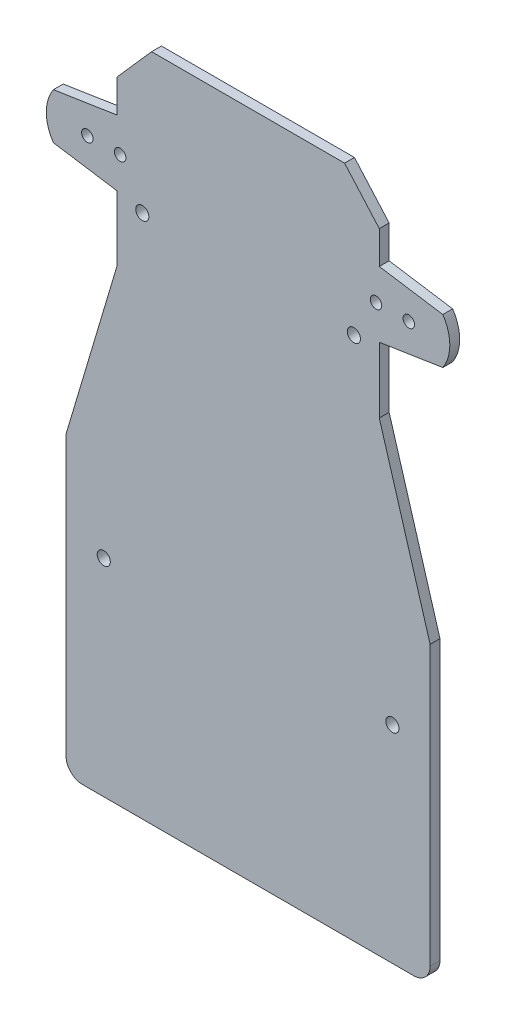
ISO-10303-21;
HEADER;
FILE_DESCRIPTION(('STEP AP214'),'2;1');
FILE_NAME('part.step','',(''),(''),'','','');
FILE_SCHEMA(('AUTOMOTIVE_DESIGN { 1 0 10303 214 1 1 1 1 }'));
ENDSEC;
DATA;
#1=APPLICATION_CONTEXT('core data for automotive mechanical design processes');
#2=APPLICATION_PROTOCOL_DEFINITION('international standard','automotive_design',2000,#1);
#3=PRODUCT_CONTEXT('',#1,'mechanical');
#4=PRODUCT('Part','Part','',(#3));
#5=PRODUCT_RELATED_PRODUCT_CATEGORY('part','',(#4));
#6=PRODUCT_DEFINITION_FORMATION('','',#4);
#7=PRODUCT_DEFINITION_CONTEXT('part definition',#1,'design');
#8=PRODUCT_DEFINITION('design','',#6,#7);
#9=PRODUCT_DEFINITION_SHAPE('','',#8);
#10=(LENGTH_UNIT() NAMED_UNIT(*) SI_UNIT(.MILLI.,.METRE.));
#11=(NAMED_UNIT(*) PLANE_ANGLE_UNIT() SI_UNIT($,.RADIAN.));
#12=(NAMED_UNIT(*) SI_UNIT($,.STERADIAN.) SOLID_ANGLE_UNIT());
#13=UNCERTAINTY_MEASURE_WITH_UNIT(LENGTH_MEASURE(1.E-05),#10,'distance_accuracy_value','');
#14=(GEOMETRIC_REPRESENTATION_CONTEXT(3) GLOBAL_UNCERTAINTY_ASSIGNED_CONTEXT((#13)) GLOBAL_UNIT_ASSIGNED_CONTEXT((#10,
#11,#12)) REPRESENTATION_CONTEXT('',''));
#15=CARTESIAN_POINT('',(0.,0.,0.));
#16=DIRECTION('',(0.,0.,1.));
#17=DIRECTION('',(1.,0.,0.));
#18=AXIS2_PLACEMENT_3D('',#15,#16,#17);
#19=CARTESIAN_POINT('',(-49.,172.,3.));
#20=DIRECTION('',(0.,0.,1.));
#21=DIRECTION('',(1.,0.,0.));
#22=AXIS2_PLACEMENT_3D('',#19,#20,#21);
#23=PLANE('',#22);
#24=CARTESIAN_POINT('',(32.2499999999999,160.,3.));
#25=DIRECTION('',(0.,0.,-1.));
#26=DIRECTION('',(-1.,0.,0.));
#27=AXIS2_PLACEMENT_3D('',#24,#25,#26);
#28=CIRCLE('',#27,2.);
#29=CARTESIAN_POINT('',(30.2499999999999,160.,3.));
#30=VERTEX_POINT('',#29);
#31=EDGE_CURVE('E641',#30,#30,#28,.T.);
#32=ORIENTED_EDGE('',*,*,#31,.T.);
#33=EDGE_LOOP('',(#32));
#34=FACE_BOUND('',#33,.T.);
#35=CARTESIAN_POINT('',(-39.,172.,3.));
#36=DIRECTION('',(0.,0.,1.));
#37=DIRECTION('',(1.,0.,0.));
#38=AXIS2_PLACEMENT_3D('',#35,#36,#37);
#39=CIRCLE('',#38,1.75);
#40=CARTESIAN_POINT('',(-37.25,172.,3.));
#41=VERTEX_POINT('',#40);
#42=EDGE_CURVE('E667',#41,#41,#39,.T.);
#43=ORIENTED_EDGE('',*,*,#42,.F.);
#44=EDGE_LOOP('',(#43));
#45=FACE_BOUND('',#44,.T.);
#46=CARTESIAN_POINT('',(-49.,172.,3.));
#47=DIRECTION('',(0.,0.,1.));
#48=DIRECTION('',(1.,0.,0.));
#49=AXIS2_PLACEMENT_3D('',#46,#47,#48);
#50=CIRCLE('',#49,1.75);
#51=CARTESIAN_POINT('',(-47.25,172.,3.));
#52=VERTEX_POINT('',#51);
#53=EDGE_CURVE('E679',#52,#52,#50,.T.);
#54=ORIENTED_EDGE('',*,*,#53,.F.);
#55=EDGE_LOOP('',(#54));
#56=FACE_BOUND('',#55,.T.);
#57=DIRECTION('',(1.,0.,0.));
#58=VECTOR('',#57,1.);
#59=CARTESIAN_POINT('',(-55.5,0.,3.));
#60=LINE('',#59,#58);
#61=CARTESIAN_POINT('',(-50.5,0.,3.));
#62=VERTEX_POINT('',#61);
#63=CARTESIAN_POINT('',(50.5,0.,3.));
#64=VERTEX_POINT('',#63);
#65=EDGE_CURVE('E220',#62,#64,#60,.T.);
#66=ORIENTED_EDGE('',*,*,#65,.T.);
#67=CARTESIAN_POINT('',(50.5,5.,3.));
#68=DIRECTION('',(0.,0.,1.));
#69=DIRECTION('',(1.,0.,0.));
#70=AXIS2_PLACEMENT_3D('',#67,#68,#69);
#71=CIRCLE('',#70,5.);
#72=CARTESIAN_POINT('',(55.5,5.00000000000003,3.));
#73=VERTEX_POINT('',#72);
#74=EDGE_CURVE('E43',#64,#73,#71,.T.);
#75=ORIENTED_EDGE('',*,*,#74,.T.);
#76=DIRECTION('',(0.,1.,0.));
#77=VECTOR('',#76,1.);
#78=CARTESIAN_POINT('',(55.5,90.,3.));
#79=LINE('',#78,#77);
#80=CARTESIAN_POINT('',(55.5,90.,3.));
#81=VERTEX_POINT('',#80);
#82=EDGE_CURVE('E218',#73,#81,#79,.T.);
#83=ORIENTED_EDGE('',*,*,#82,.T.);
#84=DIRECTION('',(-0.28565666154309,0.958332025821978,0.));
#85=VECTOR('',#84,1.);
#86=CARTESIAN_POINT('',(40.,142.,3.));
#87=LINE('',#86,#85);
#88=CARTESIAN_POINT('',(40.,142.,3.));
#89=VERTEX_POINT('',#88);
#90=EDGE_CURVE('E229',#81,#89,#87,.T.);
#91=ORIENTED_EDGE('',*,*,#90,.T.);
#92=DIRECTION('',(0.,1.,0.));
#93=VECTOR('',#92,1.);
#94=CARTESIAN_POINT('',(40.,162.,3.));
#95=LINE('',#94,#93);
#96=CARTESIAN_POINT('',(40.,162.,3.));
#97=VERTEX_POINT('',#96);
#98=EDGE_CURVE('E337',#89,#97,#95,.T.);
#99=ORIENTED_EDGE('',*,*,#98,.T.);
#100=DIRECTION('',(0.988201285573236,0.15316076257124,0.));
#101=VECTOR('',#100,1.);
#102=CARTESIAN_POINT('',(59.356157588604,165.,3.));
#103=LINE('',#102,#101);
#104=CARTESIAN_POINT('',(59.356157588604,165.,3.));
#105=VERTEX_POINT('',#104);
#106=EDGE_CURVE('E339',#97,#105,#103,.T.);
#107=ORIENTED_EDGE('',*,*,#106,.T.);
#108=CARTESIAN_POINT('',(49.,172.,3.));
#109=DIRECTION('',(0.,0.,1.));
#110=DIRECTION('',(1.,0.,0.));
#111=AXIS2_PLACEMENT_3D('',#108,#109,#110);
#112=CIRCLE('',#111,12.5);
#113=CARTESIAN_POINT('',(59.356157588604,179.,3.));
#114=VERTEX_POINT('',#113);
#115=EDGE_CURVE('E341',#105,#114,#112,.T.);
#116=ORIENTED_EDGE('',*,*,#115,.T.);
#117=DIRECTION('',(-0.988201285573236,0.15316076257124,0.));
#118=VECTOR('',#117,1.);
#119=CARTESIAN_POINT('',(39.9999999999999,182.,3.));
#120=LINE('',#119,#118);
#121=CARTESIAN_POINT('',(39.9999999999999,182.,3.));
#122=VERTEX_POINT('',#121);
#123=EDGE_CURVE('E343',#114,#122,#120,.T.);
#124=ORIENTED_EDGE('',*,*,#123,.T.);
#125=DIRECTION('',(0.,1.,0.));
#126=VECTOR('',#125,1.);
#127=CARTESIAN_POINT('',(39.9999999999999,192.,3.));
#128=LINE('',#127,#126);
#129=CARTESIAN_POINT('',(39.9999999999999,192.,3.));
#130=VERTEX_POINT('',#129);
#131=EDGE_CURVE('E345',#122,#130,#128,.T.);
#132=ORIENTED_EDGE('',*,*,#131,.T.);
#133=DIRECTION('',(-0.661437827766152,0.749999999999997,0.));
#134=VECTOR('',#133,1.);
#135=CARTESIAN_POINT('',(29.4169947557416,204.,3.));
#136=LINE('',#135,#134);
#137=CARTESIAN_POINT('',(29.4169947557416,204.,3.));
#138=VERTEX_POINT('',#137);
#139=EDGE_CURVE('E347',#130,#138,#136,.T.);
#140=ORIENTED_EDGE('',*,*,#139,.T.);
#141=DIRECTION('',(-1.,0.,0.));
#142=VECTOR('',#141,1.);
#143=CARTESIAN_POINT('',(-29.4169947557416,204.,3.));
#144=LINE('',#143,#142);
#145=CARTESIAN_POINT('',(-29.4169947557416,204.,3.));
#146=VERTEX_POINT('',#145);
#147=EDGE_CURVE('E190',#138,#146,#144,.T.);
#148=ORIENTED_EDGE('',*,*,#147,.T.);
#149=DIRECTION('',(-0.661437827766151,-0.749999999999997,0.));
#150=VECTOR('',#149,1.);
#151=CARTESIAN_POINT('',(-29.4169947557416,204.,3.));
#152=LINE('',#151,#150);
#153=CARTESIAN_POINT('',(-40.,192.,3.));
#154=VERTEX_POINT('',#153);
#155=EDGE_CURVE('E185',#146,#154,#152,.T.);
#156=ORIENTED_EDGE('',*,*,#155,.T.);
#157=DIRECTION('',(0.,-1.,0.));
#158=VECTOR('',#157,1.);
#159=CARTESIAN_POINT('',(-40.,192.,3.));
#160=LINE('',#159,#158);
#161=CARTESIAN_POINT('',(-40.,182.,3.));
#162=VERTEX_POINT('',#161);
#163=EDGE_CURVE('E174',#154,#162,#160,.T.);
#164=ORIENTED_EDGE('',*,*,#163,.T.);
#165=DIRECTION('',(-0.988201285573236,-0.153160762571241,0.));
#166=VECTOR('',#165,1.);
#167=CARTESIAN_POINT('',(-40.,182.,3.));
#168=LINE('',#167,#166);
#169=CARTESIAN_POINT('',(-59.356157588604,179.,3.));
#170=VERTEX_POINT('',#169);
#171=EDGE_CURVE('E184',#162,#170,#168,.T.);
#172=ORIENTED_EDGE('',*,*,#171,.T.);
#173=CARTESIAN_POINT('',(-49.,172.,3.));
#174=DIRECTION('',(0.,0.,1.));
#175=DIRECTION('',(1.,0.,0.));
#176=AXIS2_PLACEMENT_3D('',#173,#174,#175);
#177=CIRCLE('',#176,12.5);
#178=CARTESIAN_POINT('',(-59.356157588604,165.,3.));
#179=VERTEX_POINT('',#178);
#180=EDGE_CURVE('E306',#170,#179,#177,.T.);
#181=ORIENTED_EDGE('',*,*,#180,.T.);
#182=DIRECTION('',(0.988201285573236,-0.15316076257124,0.));
#183=VECTOR('',#182,1.);
#184=CARTESIAN_POINT('',(-59.356157588604,165.,3.));
#185=LINE('',#184,#183);
#186=CARTESIAN_POINT('',(-40.,162.,3.));
#187=VERTEX_POINT('',#186);
#188=EDGE_CURVE('E353',#179,#187,#185,.T.);
#189=ORIENTED_EDGE('',*,*,#188,.T.);
#190=DIRECTION('',(0.,-1.,0.));
#191=VECTOR('',#190,1.);
#192=CARTESIAN_POINT('',(-40.,162.,3.));
#193=LINE('',#192,#191);
#194=CARTESIAN_POINT('',(-40.,142.,3.));
#195=VERTEX_POINT('',#194);
#196=EDGE_CURVE('E357',#187,#195,#193,.T.);
#197=ORIENTED_EDGE('',*,*,#196,.T.);
#198=DIRECTION('',(-0.28565666154309,-0.958332025821978,0.));
#199=VECTOR('',#198,1.);
#200=CARTESIAN_POINT('',(-40.,142.,3.));
#201=LINE('',#200,#199);
#202=CARTESIAN_POINT('',(-55.5,90.,3.));
#203=VERTEX_POINT('',#202);
#204=EDGE_CURVE('E332',#195,#203,#201,.T.);
#205=ORIENTED_EDGE('',*,*,#204,.T.);
#206=DIRECTION('',(0.,-1.,0.));
#207=VECTOR('',#206,1.);
#208=CARTESIAN_POINT('',(-55.5,90.,3.));
#209=LINE('',#208,#207);
#210=CARTESIAN_POINT('',(-55.5,5.00000000000003,3.));
#211=VERTEX_POINT('',#210);
#212=EDGE_CURVE('E328',#203,#211,#209,.T.);
#213=ORIENTED_EDGE('',*,*,#212,.T.);
#214=CARTESIAN_POINT('',(-50.5,5.,3.));
#215=DIRECTION('',(0.,0.,1.));
#216=DIRECTION('',(1.,0.,0.));
#217=AXIS2_PLACEMENT_3D('',#214,#215,#216);
#218=CIRCLE('',#217,5.);
#219=EDGE_CURVE('E215',#211,#62,#218,.T.);
#220=ORIENTED_EDGE('',*,*,#219,.T.);
#221=EDGE_LOOP('',(#66,#75,#83,#91,#99,#107,#116,#124,#132,#140,#148,#156,#164,#172,#181,#189,
#197,#205,#213,#220));
#222=FACE_BOUND('',#221,.T.);
#223=CARTESIAN_POINT('',(49.,172.,3.));
#224=DIRECTION('',(0.,0.,1.));
#225=DIRECTION('',(1.,0.,0.));
#226=AXIS2_PLACEMENT_3D('',#223,#224,#225);
#227=CIRCLE('',#226,1.75);
#228=CARTESIAN_POINT('',(50.75,172.,3.));
#229=VERTEX_POINT('',#228);
#230=EDGE_CURVE('E350',#229,#229,#227,.T.);
#231=ORIENTED_EDGE('',*,*,#230,.F.);
#232=EDGE_LOOP('',(#231));
#233=FACE_BOUND('',#232,.T.);
#234=CARTESIAN_POINT('',(39.,172.,3.));
#235=DIRECTION('',(0.,0.,1.));
#236=DIRECTION('',(1.,0.,0.));
#237=AXIS2_PLACEMENT_3D('',#234,#235,#236);
#238=CIRCLE('',#237,1.75);
#239=CARTESIAN_POINT('',(40.75,172.,3.));
#240=VERTEX_POINT('',#239);
#241=EDGE_CURVE('E673',#240,#240,#238,.T.);
#242=ORIENTED_EDGE('',*,*,#241,.F.);
#243=EDGE_LOOP('',(#242));
#244=FACE_BOUND('',#243,.T.);
#245=CARTESIAN_POINT('',(44.,63.,3.));
#246=DIRECTION('',(0.,0.,-1.));
#247=DIRECTION('',(-1.,0.,0.));
#248=AXIS2_PLACEMENT_3D('',#245,#246,#247);
#249=CIRCLE('',#248,2.);
#250=CARTESIAN_POINT('',(42.,63.,3.));
#251=VERTEX_POINT('',#250);
#252=EDGE_CURVE('E663',#251,#251,#249,.T.);
#253=ORIENTED_EDGE('',*,*,#252,.T.);
#254=EDGE_LOOP('',(#253));
#255=FACE_BOUND('',#254,.T.);
#256=CARTESIAN_POINT('',(-44.,63.,3.));
#257=DIRECTION('',(0.,0.,-1.));
#258=DIRECTION('',(-1.,0.,0.));
#259=AXIS2_PLACEMENT_3D('',#256,#257,#258);
#260=CIRCLE('',#259,2.);
#261=CARTESIAN_POINT('',(-46.,63.,3.));
#262=VERTEX_POINT('',#261);
#263=EDGE_CURVE('E657',#262,#262,#260,.T.);
#264=ORIENTED_EDGE('',*,*,#263,.T.);
#265=EDGE_LOOP('',(#264));
#266=FACE_BOUND('',#265,.T.);
#267=CARTESIAN_POINT('',(-32.2500000000001,160.,3.));
#268=DIRECTION('',(0.,0.,-1.));
#269=DIRECTION('',(-1.,0.,0.));
#270=AXIS2_PLACEMENT_3D('',#267,#268,#269);
#271=CIRCLE('',#270,2.);
#272=CARTESIAN_POINT('',(-34.2500000000001,160.,3.));
#273=VERTEX_POINT('',#272);
#274=EDGE_CURVE('E651',#273,#273,#271,.T.);
#275=ORIENTED_EDGE('',*,*,#274,.T.);
#276=EDGE_LOOP('',(#275));
#277=FACE_BOUND('',#276,.T.);
#278=ADVANCED_FACE('F35',(#34,#45,#56,#222,#233,#244,#255,#266,#277),#23,.T.);
#279=CARTESIAN_POINT('',(-49.,172.,0.));
#280=DIRECTION('',(0.,0.,1.));
#281=DIRECTION('',(1.,0.,0.));
#282=AXIS2_PLACEMENT_3D('',#279,#280,#281);
#283=PLANE('',#282);
#284=CARTESIAN_POINT('',(32.2499999999999,160.,0.));
#285=DIRECTION('',(0.,0.,-1.));
#286=DIRECTION('',(-1.,0.,0.));
#287=AXIS2_PLACEMENT_3D('',#284,#285,#286);
#288=CIRCLE('',#287,2.);
#289=CARTESIAN_POINT('',(30.2499999999999,160.,0.));
#290=VERTEX_POINT('',#289);
#291=EDGE_CURVE('E644',#290,#290,#288,.T.);
#292=ORIENTED_EDGE('',*,*,#291,.F.);
#293=EDGE_LOOP('',(#292));
#294=FACE_BOUND('',#293,.T.);
#295=CARTESIAN_POINT('',(-32.2500000000001,160.,0.));
#296=DIRECTION('',(0.,0.,-1.));
#297=DIRECTION('',(-1.,0.,0.));
#298=AXIS2_PLACEMENT_3D('',#295,#296,#297);
#299=CIRCLE('',#298,2.);
#300=CARTESIAN_POINT('',(-34.2500000000001,160.,0.));
#301=VERTEX_POINT('',#300);
#302=EDGE_CURVE('E646',#301,#301,#299,.T.);
#303=ORIENTED_EDGE('',*,*,#302,.F.);
#304=EDGE_LOOP('',(#303));
#305=FACE_BOUND('',#304,.T.);
#306=CARTESIAN_POINT('',(-44.,63.,0.));
#307=DIRECTION('',(0.,0.,-1.));
#308=DIRECTION('',(-1.,0.,0.));
#309=AXIS2_PLACEMENT_3D('',#306,#307,#308);
#310=CIRCLE('',#309,2.);
#311=CARTESIAN_POINT('',(-46.,63.,0.));
#312=VERTEX_POINT('',#311);
#313=EDGE_CURVE('E654',#312,#312,#310,.T.);
#314=ORIENTED_EDGE('',*,*,#313,.F.);
#315=EDGE_LOOP('',(#314));
#316=FACE_BOUND('',#315,.T.);
#317=CARTESIAN_POINT('',(44.,63.,0.));
#318=DIRECTION('',(0.,0.,-1.));
#319=DIRECTION('',(-1.,0.,0.));
#320=AXIS2_PLACEMENT_3D('',#317,#318,#319);
#321=CIRCLE('',#320,2.);
#322=CARTESIAN_POINT('',(42.,63.,0.));
#323=VERTEX_POINT('',#322);
#324=EDGE_CURVE('E660',#323,#323,#321,.T.);
#325=ORIENTED_EDGE('',*,*,#324,.F.);
#326=EDGE_LOOP('',(#325));
#327=FACE_BOUND('',#326,.T.);
#328=DIRECTION('',(0.,1.,0.));
#329=VECTOR('',#328,1.);
#330=CARTESIAN_POINT('',(55.5,90.,0.));
#331=LINE('',#330,#329);
#332=CARTESIAN_POINT('',(55.5,5.00000000000003,0.));
#333=VERTEX_POINT('',#332);
#334=CARTESIAN_POINT('',(55.5,90.,0.));
#335=VERTEX_POINT('',#334);
#336=EDGE_CURVE('E238',#333,#335,#331,.T.);
#337=ORIENTED_EDGE('',*,*,#336,.F.);
#338=CARTESIAN_POINT('',(50.5,5.,0.));
#339=DIRECTION('',(0.,0.,1.));
#340=DIRECTION('',(1.,0.,0.));
#341=AXIS2_PLACEMENT_3D('',#338,#339,#340);
#342=CIRCLE('',#341,5.);
#343=CARTESIAN_POINT('',(50.5,0.,0.));
#344=VERTEX_POINT('',#343);
#345=EDGE_CURVE('E209',#333,#344,#342,.F.);
#346=ORIENTED_EDGE('',*,*,#345,.T.);
#347=DIRECTION('',(1.,0.,0.));
#348=VECTOR('',#347,1.);
#349=CARTESIAN_POINT('',(-55.5,0.,0.));
#350=LINE('',#349,#348);
#351=CARTESIAN_POINT('',(-50.5,0.,0.));
#352=VERTEX_POINT('',#351);
#353=EDGE_CURVE('E236',#352,#344,#350,.T.);
#354=ORIENTED_EDGE('',*,*,#353,.F.);
#355=CARTESIAN_POINT('',(-50.5,5.,0.));
#356=DIRECTION('',(0.,0.,1.));
#357=DIRECTION('',(1.,0.,0.));
#358=AXIS2_PLACEMENT_3D('',#355,#356,#357);
#359=CIRCLE('',#358,5.);
#360=CARTESIAN_POINT('',(-55.5,5.00000000000003,0.));
#361=VERTEX_POINT('',#360);
#362=EDGE_CURVE('E202',#352,#361,#359,.F.);
#363=ORIENTED_EDGE('',*,*,#362,.T.);
#364=DIRECTION('',(0.,-1.,0.));
#365=VECTOR('',#364,1.);
#366=CARTESIAN_POINT('',(-55.5,90.,0.));
#367=LINE('',#366,#365);
#368=CARTESIAN_POINT('',(-55.5,90.,0.));
#369=VERTEX_POINT('',#368);
#370=EDGE_CURVE('E241',#369,#361,#367,.T.);
#371=ORIENTED_EDGE('',*,*,#370,.F.);
#372=DIRECTION('',(-0.28565666154309,-0.958332025821978,0.));
#373=VECTOR('',#372,1.);
#374=CARTESIAN_POINT('',(-40.,142.,0.));
#375=LINE('',#374,#373);
#376=CARTESIAN_POINT('',(-40.,142.,0.));
#377=VERTEX_POINT('',#376);
#378=EDGE_CURVE('E245',#377,#369,#375,.T.);
#379=ORIENTED_EDGE('',*,*,#378,.F.);
#380=DIRECTION('',(0.,-1.,0.));
#381=VECTOR('',#380,1.);
#382=CARTESIAN_POINT('',(-40.,162.,0.));
#383=LINE('',#382,#381);
#384=CARTESIAN_POINT('',(-40.,162.,0.));
#385=VERTEX_POINT('',#384);
#386=EDGE_CURVE('E314',#385,#377,#383,.T.);
#387=ORIENTED_EDGE('',*,*,#386,.F.);
#388=DIRECTION('',(0.988201285573236,-0.15316076257124,0.));
#389=VECTOR('',#388,1.);
#390=CARTESIAN_POINT('',(-59.356157588604,165.,0.));
#391=LINE('',#390,#389);
#392=CARTESIAN_POINT('',(-59.356157588604,165.,0.));
#393=VERTEX_POINT('',#392);
#394=EDGE_CURVE('E312',#393,#385,#391,.T.);
#395=ORIENTED_EDGE('',*,*,#394,.F.);
#396=CARTESIAN_POINT('',(-49.,172.,0.));
#397=DIRECTION('',(0.,0.,1.));
#398=DIRECTION('',(1.,0.,0.));
#399=AXIS2_PLACEMENT_3D('',#396,#397,#398);
#400=CIRCLE('',#399,12.5);
#401=CARTESIAN_POINT('',(-59.356157588604,179.,0.));
#402=VERTEX_POINT('',#401);
#403=EDGE_CURVE('E305',#402,#393,#400,.T.);
#404=ORIENTED_EDGE('',*,*,#403,.F.);
#405=DIRECTION('',(-0.988201285573236,-0.153160762571241,0.));
#406=VECTOR('',#405,1.);
#407=CARTESIAN_POINT('',(-40.,182.,0.));
#408=LINE('',#407,#406);
#409=CARTESIAN_POINT('',(-40.,182.,0.));
#410=VERTEX_POINT('',#409);
#411=EDGE_CURVE('E310',#410,#402,#408,.T.);
#412=ORIENTED_EDGE('',*,*,#411,.F.);
#413=DIRECTION('',(0.,-1.,0.));
#414=VECTOR('',#413,1.);
#415=CARTESIAN_POINT('',(-40.,192.,0.));
#416=LINE('',#415,#414);
#417=CARTESIAN_POINT('',(-40.,192.,0.));
#418=VERTEX_POINT('',#417);
#419=EDGE_CURVE('E316',#418,#410,#416,.T.);
#420=ORIENTED_EDGE('',*,*,#419,.F.);
#421=DIRECTION('',(-0.661437827766151,-0.749999999999997,0.));
#422=VECTOR('',#421,1.);
#423=CARTESIAN_POINT('',(-29.4169947557416,204.,0.));
#424=LINE('',#423,#422);
#425=CARTESIAN_POINT('',(-29.4169947557416,204.,0.));
#426=VERTEX_POINT('',#425);
#427=EDGE_CURVE('E198',#426,#418,#424,.T.);
#428=ORIENTED_EDGE('',*,*,#427,.F.);
#429=DIRECTION('',(-1.,0.,0.));
#430=VECTOR('',#429,1.);
#431=CARTESIAN_POINT('',(-29.4169947557416,204.,0.));
#432=LINE('',#431,#430);
#433=CARTESIAN_POINT('',(29.4169947557416,204.,0.));
#434=VERTEX_POINT('',#433);
#435=EDGE_CURVE('E194',#434,#426,#432,.T.);
#436=ORIENTED_EDGE('',*,*,#435,.F.);
#437=DIRECTION('',(-0.661437827766152,0.749999999999997,0.));
#438=VECTOR('',#437,1.);
#439=CARTESIAN_POINT('',(29.4169947557416,204.,0.));
#440=LINE('',#439,#438);
#441=CARTESIAN_POINT('',(39.9999999999999,192.,0.));
#442=VERTEX_POINT('',#441);
#443=EDGE_CURVE('E260',#442,#434,#440,.T.);
#444=ORIENTED_EDGE('',*,*,#443,.F.);
#445=DIRECTION('',(0.,1.,0.));
#446=VECTOR('',#445,1.);
#447=CARTESIAN_POINT('',(39.9999999999999,192.,0.));
#448=LINE('',#447,#446);
#449=CARTESIAN_POINT('',(39.9999999999999,182.,0.));
#450=VERTEX_POINT('',#449);
#451=EDGE_CURVE('E258',#450,#442,#448,.T.);
#452=ORIENTED_EDGE('',*,*,#451,.F.);
#453=DIRECTION('',(-0.988201285573236,0.15316076257124,0.));
#454=VECTOR('',#453,1.);
#455=CARTESIAN_POINT('',(39.9999999999999,182.,0.));
#456=LINE('',#455,#454);
#457=CARTESIAN_POINT('',(59.356157588604,179.,0.));
#458=VERTEX_POINT('',#457);
#459=EDGE_CURVE('E256',#458,#450,#456,.T.);
#460=ORIENTED_EDGE('',*,*,#459,.F.);
#461=CARTESIAN_POINT('',(49.,172.,0.));
#462=DIRECTION('',(0.,0.,1.));
#463=DIRECTION('',(1.,0.,0.));
#464=AXIS2_PLACEMENT_3D('',#461,#462,#463);
#465=CIRCLE('',#464,12.5);
#466=CARTESIAN_POINT('',(59.356157588604,165.,0.));
#467=VERTEX_POINT('',#466);
#468=EDGE_CURVE('E254',#467,#458,#465,.T.);
#469=ORIENTED_EDGE('',*,*,#468,.F.);
#470=DIRECTION('',(0.988201285573236,0.15316076257124,0.));
#471=VECTOR('',#470,1.);
#472=CARTESIAN_POINT('',(59.356157588604,165.,0.));
#473=LINE('',#472,#471);
#474=CARTESIAN_POINT('',(40.,162.,0.));
#475=VERTEX_POINT('',#474);
#476=EDGE_CURVE('E252',#475,#467,#473,.T.);
#477=ORIENTED_EDGE('',*,*,#476,.F.);
#478=DIRECTION('',(0.,1.,0.));
#479=VECTOR('',#478,1.);
#480=CARTESIAN_POINT('',(40.,162.,0.));
#481=LINE('',#480,#479);
#482=CARTESIAN_POINT('',(40.,142.,0.));
#483=VERTEX_POINT('',#482);
#484=EDGE_CURVE('E250',#483,#475,#481,.T.);
#485=ORIENTED_EDGE('',*,*,#484,.F.);
#486=DIRECTION('',(-0.28565666154309,0.958332025821978,0.));
#487=VECTOR('',#486,1.);
#488=CARTESIAN_POINT('',(40.,142.,0.));
#489=LINE('',#488,#487);
#490=EDGE_CURVE('E243',#335,#483,#489,.T.);
#491=ORIENTED_EDGE('',*,*,#490,.F.);
#492=EDGE_LOOP('',(#337,#346,#354,#363,#371,#379,#387,#395,#404,#412,#420,#428,#436,#444,#452,
#460,#469,#477,#485,#491));
#493=FACE_BOUND('',#492,.T.);
#494=CARTESIAN_POINT('',(49.,172.,0.));
#495=DIRECTION('',(0.,0.,1.));
#496=DIRECTION('',(1.,0.,0.));
#497=AXIS2_PLACEMENT_3D('',#494,#495,#496);
#498=CIRCLE('',#497,1.75);
#499=CARTESIAN_POINT('',(50.75,172.,0.));
#500=VERTEX_POINT('',#499);
#501=EDGE_CURVE('E682',#500,#500,#498,.T.);
#502=ORIENTED_EDGE('',*,*,#501,.T.);
#503=EDGE_LOOP('',(#502));
#504=FACE_BOUND('',#503,.T.);
#505=CARTESIAN_POINT('',(-49.,172.,0.));
#506=DIRECTION('',(0.,0.,1.));
#507=DIRECTION('',(1.,0.,0.));
#508=AXIS2_PLACEMENT_3D('',#505,#506,#507);
#509=CIRCLE('',#508,1.75);
#510=CARTESIAN_POINT('',(-47.25,172.,0.));
#511=VERTEX_POINT('',#510);
#512=EDGE_CURVE('E676',#511,#511,#509,.T.);
#513=ORIENTED_EDGE('',*,*,#512,.T.);
#514=EDGE_LOOP('',(#513));
#515=FACE_BOUND('',#514,.T.);
#516=CARTESIAN_POINT('',(39.,172.,0.));
#517=DIRECTION('',(0.,0.,1.));
#518=DIRECTION('',(1.,0.,0.));
#519=AXIS2_PLACEMENT_3D('',#516,#517,#518);
#520=CIRCLE('',#519,1.75);
#521=CARTESIAN_POINT('',(40.75,172.,0.));
#522=VERTEX_POINT('',#521);
#523=EDGE_CURVE('E670',#522,#522,#520,.T.);
#524=ORIENTED_EDGE('',*,*,#523,.T.);
#525=EDGE_LOOP('',(#524));
#526=FACE_BOUND('',#525,.T.);
#527=CARTESIAN_POINT('',(-39.,172.,0.));
#528=DIRECTION('',(0.,0.,1.));
#529=DIRECTION('',(1.,0.,0.));
#530=AXIS2_PLACEMENT_3D('',#527,#528,#529);
#531=CIRCLE('',#530,1.75);
#532=CARTESIAN_POINT('',(-37.25,172.,0.));
#533=VERTEX_POINT('',#532);
#534=EDGE_CURVE('E666',#533,#533,#531,.T.);
#535=ORIENTED_EDGE('',*,*,#534,.T.);
#536=EDGE_LOOP('',(#535));
#537=FACE_BOUND('',#536,.T.);
#538=ADVANCED_FACE('F234',(#294,#305,#316,#327,#493,#504,#515,#526,#537),#283,.F.);
#539=CARTESIAN_POINT('',(-29.4169947557416,204.,3.));
#540=DIRECTION('',(0.749999999999997,-0.661437827766151,0.));
#541=DIRECTION('',(0.661437827766151,0.749999999999997,0.));
#542=AXIS2_PLACEMENT_3D('',#539,#540,#541);
#543=PLANE('',#542);
#544=ORIENTED_EDGE('',*,*,#427,.T.);
#545=DIRECTION('',(0.,0.,-1.));
#546=VECTOR('',#545,1.);
#547=CARTESIAN_POINT('',(-40.,192.,3.));
#548=LINE('',#547,#546);
#549=EDGE_CURVE('E178',#154,#418,#548,.T.);
#550=ORIENTED_EDGE('',*,*,#549,.F.);
#551=ORIENTED_EDGE('',*,*,#155,.F.);
#552=DIRECTION('',(0.,0.,-1.));
#553=VECTOR('',#552,1.);
#554=CARTESIAN_POINT('',(-29.4169947557416,204.,3.));
#555=LINE('',#554,#553);
#556=EDGE_CURVE('E263',#146,#426,#555,.T.);
#557=ORIENTED_EDGE('',*,*,#556,.T.);
#558=EDGE_LOOP('',(#544,#550,#551,#557));
#559=FACE_BOUND('',#558,.T.);
#560=ADVANCED_FACE('F196',(#559),#543,.F.);
#561=CARTESIAN_POINT('',(-40.,192.,3.));
#562=DIRECTION('',(1.,0.,0.));
#563=DIRECTION('',(0.,1.,0.));
#564=AXIS2_PLACEMENT_3D('',#561,#562,#563);
#565=PLANE('',#564);
#566=ORIENTED_EDGE('',*,*,#419,.T.);
#567=DIRECTION('',(0.,0.,-1.));
#568=VECTOR('',#567,1.);
#569=CARTESIAN_POINT('',(-40.,182.,3.));
#570=LINE('',#569,#568);
#571=EDGE_CURVE('E181',#162,#410,#570,.T.);
#572=ORIENTED_EDGE('',*,*,#571,.F.);
#573=ORIENTED_EDGE('',*,*,#163,.F.);
#574=ORIENTED_EDGE('',*,*,#549,.T.);
#575=EDGE_LOOP('',(#566,#572,#573,#574));
#576=FACE_BOUND('',#575,.T.);
#577=ADVANCED_FACE('F176',(#576),#565,.F.);
#578=CARTESIAN_POINT('',(-40.,182.,3.));
#579=DIRECTION('',(0.153160762571241,-0.988201285573236,0.));
#580=DIRECTION('',(0.988201285573236,0.153160762571241,0.));
#581=AXIS2_PLACEMENT_3D('',#578,#579,#580);
#582=PLANE('',#581);
#583=ORIENTED_EDGE('',*,*,#411,.T.);
#584=DIRECTION('',(0.,0.,-1.));
#585=VECTOR('',#584,1.);
#586=CARTESIAN_POINT('',(-59.356157588604,179.,3.));
#587=LINE('',#586,#585);
#588=EDGE_CURVE('E204',#170,#402,#587,.T.);
#589=ORIENTED_EDGE('',*,*,#588,.F.);
#590=ORIENTED_EDGE('',*,*,#171,.F.);
#591=ORIENTED_EDGE('',*,*,#571,.T.);
#592=EDGE_LOOP('',(#583,#589,#590,#591));
#593=FACE_BOUND('',#592,.T.);
#594=ADVANCED_FACE('F351',(#593),#582,.F.);
#595=CARTESIAN_POINT('',(-49.,172.,3.));
#596=DIRECTION('',(0.,0.,-1.));
#597=DIRECTION('',(-1.,0.,0.));
#598=AXIS2_PLACEMENT_3D('',#595,#596,#597);
#599=CYLINDRICAL_SURFACE('',#598,12.5);
#600=ORIENTED_EDGE('',*,*,#403,.T.);
#601=DIRECTION('',(0.,0.,-1.));
#602=VECTOR('',#601,1.);
#603=CARTESIAN_POINT('',(-59.356157588604,165.,3.));
#604=LINE('',#603,#602);
#605=EDGE_CURVE('E296',#179,#393,#604,.T.);
#606=ORIENTED_EDGE('',*,*,#605,.F.);
#607=ORIENTED_EDGE('',*,*,#180,.F.);
#608=ORIENTED_EDGE('',*,*,#588,.T.);
#609=EDGE_LOOP('',(#600,#606,#607,#608));
#610=FACE_BOUND('',#609,.T.);
#611=ADVANCED_FACE('F303',(#610),#599,.T.);
#612=CARTESIAN_POINT('',(-59.356157588604,165.,3.));
#613=DIRECTION('',(0.15316076257124,0.988201285573236,0.));
#614=DIRECTION('',(-0.988201285573236,0.15316076257124,0.));
#615=AXIS2_PLACEMENT_3D('',#612,#613,#614);
#616=PLANE('',#615);
#617=ORIENTED_EDGE('',*,*,#394,.T.);
#618=DIRECTION('',(0.,0.,-1.));
#619=VECTOR('',#618,1.);
#620=CARTESIAN_POINT('',(-40.,162.,3.));
#621=LINE('',#620,#619);
#622=EDGE_CURVE('E293',#187,#385,#621,.T.);
#623=ORIENTED_EDGE('',*,*,#622,.F.);
#624=ORIENTED_EDGE('',*,*,#188,.F.);
#625=ORIENTED_EDGE('',*,*,#605,.T.);
#626=EDGE_LOOP('',(#617,#623,#624,#625));
#627=FACE_BOUND('',#626,.T.);
#628=ADVANCED_FACE('F364',(#627),#616,.F.);
#629=CARTESIAN_POINT('',(-40.,162.,3.));
#630=DIRECTION('',(1.,0.,0.));
#631=DIRECTION('',(0.,1.,0.));
#632=AXIS2_PLACEMENT_3D('',#629,#630,#631);
#633=PLANE('',#632);
#634=ORIENTED_EDGE('',*,*,#386,.T.);
#635=DIRECTION('',(0.,0.,-1.));
#636=VECTOR('',#635,1.);
#637=CARTESIAN_POINT('',(-40.,142.,3.));
#638=LINE('',#637,#636);
#639=EDGE_CURVE('E290',#195,#377,#638,.T.);
#640=ORIENTED_EDGE('',*,*,#639,.F.);
#641=ORIENTED_EDGE('',*,*,#196,.F.);
#642=ORIENTED_EDGE('',*,*,#622,.T.);
#643=EDGE_LOOP('',(#634,#640,#641,#642));
#644=FACE_BOUND('',#643,.T.);
#645=ADVANCED_FACE('F362',(#644),#633,.F.);
#646=CARTESIAN_POINT('',(-40.,142.,3.));
#647=DIRECTION('',(0.958332025821978,-0.28565666154309,0.));
#648=DIRECTION('',(0.28565666154309,0.958332025821978,0.));
#649=AXIS2_PLACEMENT_3D('',#646,#647,#648);
#650=PLANE('',#649);
#651=ORIENTED_EDGE('',*,*,#378,.T.);
#652=DIRECTION('',(0.,0.,-1.));
#653=VECTOR('',#652,1.);
#654=CARTESIAN_POINT('',(-55.5,90.,3.));
#655=LINE('',#654,#653);
#656=EDGE_CURVE('E287',#203,#369,#655,.T.);
#657=ORIENTED_EDGE('',*,*,#656,.F.);
#658=ORIENTED_EDGE('',*,*,#204,.F.);
#659=ORIENTED_EDGE('',*,*,#639,.T.);
#660=EDGE_LOOP('',(#651,#657,#658,#659));
#661=FACE_BOUND('',#660,.T.);
#662=ADVANCED_FACE('F323',(#661),#650,.F.);
#663=CARTESIAN_POINT('',(-55.5,90.,3.));
#664=DIRECTION('',(1.,0.,0.));
#665=DIRECTION('',(0.,1.,0.));
#666=AXIS2_PLACEMENT_3D('',#663,#664,#665);
#667=PLANE('',#666);
#668=ORIENTED_EDGE('',*,*,#370,.T.);
#669=DIRECTION('',(0.,0.,-1.));
#670=VECTOR('',#669,1.);
#671=CARTESIAN_POINT('',(-55.5,5.,3.));
#672=LINE('',#671,#670);
#673=EDGE_CURVE('E11',#361,#211,#672,.F.);
#674=ORIENTED_EDGE('',*,*,#673,.T.);
#675=ORIENTED_EDGE('',*,*,#212,.F.);
#676=ORIENTED_EDGE('',*,*,#656,.T.);
#677=EDGE_LOOP('',(#668,#674,#675,#676));
#678=FACE_BOUND('',#677,.T.);
#679=ADVANCED_FACE('F327',(#678),#667,.F.);
#680=CARTESIAN_POINT('',(-55.5,0.,3.));
#681=DIRECTION('',(0.,1.,0.));
#682=DIRECTION('',(0.,0.,1.));
#683=AXIS2_PLACEMENT_3D('',#680,#681,#682);
#684=PLANE('',#683);
#685=ORIENTED_EDGE('',*,*,#353,.T.);
#686=DIRECTION('',(0.,0.,-1.));
#687=VECTOR('',#686,1.);
#688=CARTESIAN_POINT('',(50.5,0.,3.));
#689=LINE('',#688,#687);
#690=EDGE_CURVE('E56',#344,#64,#689,.F.);
#691=ORIENTED_EDGE('',*,*,#690,.T.);
#692=ORIENTED_EDGE('',*,*,#65,.F.);
#693=DIRECTION('',(0.,0.,-1.));
#694=VECTOR('',#693,1.);
#695=CARTESIAN_POINT('',(-50.5,0.,3.));
#696=LINE('',#695,#694);
#697=EDGE_CURVE('E211',#62,#352,#696,.T.);
#698=ORIENTED_EDGE('',*,*,#697,.T.);
#699=EDGE_LOOP('',(#685,#691,#692,#698));
#700=FACE_BOUND('',#699,.T.);
#701=ADVANCED_FACE('F239',(#700),#684,.F.);
#702=CARTESIAN_POINT('',(55.5,90.,3.));
#703=DIRECTION('',(-1.,0.,0.));
#704=DIRECTION('',(0.,-1.,0.));
#705=AXIS2_PLACEMENT_3D('',#702,#703,#704);
#706=PLANE('',#705);
#707=ORIENTED_EDGE('',*,*,#82,.F.);
#708=DIRECTION('',(0.,0.,-1.));
#709=VECTOR('',#708,1.);
#710=CARTESIAN_POINT('',(55.5,5.,3.));
#711=LINE('',#710,#709);
#712=EDGE_CURVE('E199',#73,#333,#711,.T.);
#713=ORIENTED_EDGE('',*,*,#712,.T.);
#714=ORIENTED_EDGE('',*,*,#336,.T.);
#715=DIRECTION('',(0.,0.,-1.));
#716=VECTOR('',#715,1.);
#717=CARTESIAN_POINT('',(55.5,90.,3.));
#718=LINE('',#717,#716);
#719=EDGE_CURVE('E227',#81,#335,#718,.T.);
#720=ORIENTED_EDGE('',*,*,#719,.F.);
#721=EDGE_LOOP('',(#707,#713,#714,#720));
#722=FACE_BOUND('',#721,.T.);
#723=ADVANCED_FACE('F224',(#722),#706,.F.);
#724=CARTESIAN_POINT('',(40.,142.,3.));
#725=DIRECTION('',(-0.958332025821978,-0.28565666154309,0.));
#726=DIRECTION('',(0.28565666154309,-0.958332025821978,0.));
#727=AXIS2_PLACEMENT_3D('',#724,#725,#726);
#728=PLANE('',#727);
#729=ORIENTED_EDGE('',*,*,#490,.T.);
#730=DIRECTION('',(0.,0.,-1.));
#731=VECTOR('',#730,1.);
#732=CARTESIAN_POINT('',(40.,142.,3.));
#733=LINE('',#732,#731);
#734=EDGE_CURVE('E283',#89,#483,#733,.T.);
#735=ORIENTED_EDGE('',*,*,#734,.F.);
#736=ORIENTED_EDGE('',*,*,#90,.F.);
#737=ORIENTED_EDGE('',*,*,#719,.T.);
#738=EDGE_LOOP('',(#729,#735,#736,#737));
#739=FACE_BOUND('',#738,.T.);
#740=ADVANCED_FACE('F414',(#739),#728,.F.);
#741=CARTESIAN_POINT('',(40.,162.,3.));
#742=DIRECTION('',(-1.,0.,0.));
#743=DIRECTION('',(0.,-1.,0.));
#744=AXIS2_PLACEMENT_3D('',#741,#742,#743);
#745=PLANE('',#744);
#746=ORIENTED_EDGE('',*,*,#484,.T.);
#747=DIRECTION('',(0.,0.,-1.));
#748=VECTOR('',#747,1.);
#749=CARTESIAN_POINT('',(40.,162.,3.));
#750=LINE('',#749,#748);
#751=EDGE_CURVE('E280',#97,#475,#750,.T.);
#752=ORIENTED_EDGE('',*,*,#751,.F.);
#753=ORIENTED_EDGE('',*,*,#98,.F.);
#754=ORIENTED_EDGE('',*,*,#734,.T.);
#755=EDGE_LOOP('',(#746,#752,#753,#754));
#756=FACE_BOUND('',#755,.T.);
#757=ADVANCED_FACE('F410',(#756),#745,.F.);
#758=CARTESIAN_POINT('',(59.356157588604,165.,3.));
#759=DIRECTION('',(-0.15316076257124,0.988201285573236,0.));
#760=DIRECTION('',(-0.988201285573236,-0.15316076257124,0.));
#761=AXIS2_PLACEMENT_3D('',#758,#759,#760);
#762=PLANE('',#761);
#763=ORIENTED_EDGE('',*,*,#476,.T.);
#764=DIRECTION('',(0.,0.,-1.));
#765=VECTOR('',#764,1.);
#766=CARTESIAN_POINT('',(59.356157588604,165.,3.));
#767=LINE('',#766,#765);
#768=EDGE_CURVE('E277',#105,#467,#767,.T.);
#769=ORIENTED_EDGE('',*,*,#768,.F.);
#770=ORIENTED_EDGE('',*,*,#106,.F.);
#771=ORIENTED_EDGE('',*,*,#751,.T.);
#772=EDGE_LOOP('',(#763,#769,#770,#771));
#773=FACE_BOUND('',#772,.T.);
#774=ADVANCED_FACE('F406',(#773),#762,.F.);
#775=CARTESIAN_POINT('',(49.,172.,3.));
#776=DIRECTION('',(0.,0.,-1.));
#777=DIRECTION('',(-1.,0.,0.));
#778=AXIS2_PLACEMENT_3D('',#775,#776,#777);
#779=CYLINDRICAL_SURFACE('',#778,12.5);
#780=ORIENTED_EDGE('',*,*,#468,.T.);
#781=DIRECTION('',(0.,0.,-1.));
#782=VECTOR('',#781,1.);
#783=CARTESIAN_POINT('',(59.356157588604,179.,3.));
#784=LINE('',#783,#782);
#785=EDGE_CURVE('E274',#114,#458,#784,.T.);
#786=ORIENTED_EDGE('',*,*,#785,.F.);
#787=ORIENTED_EDGE('',*,*,#115,.F.);
#788=ORIENTED_EDGE('',*,*,#768,.T.);
#789=EDGE_LOOP('',(#780,#786,#787,#788));
#790=FACE_BOUND('',#789,.T.);
#791=ADVANCED_FACE('F402',(#790),#779,.T.);
#792=CARTESIAN_POINT('',(39.9999999999999,182.,3.));
#793=DIRECTION('',(-0.15316076257124,-0.988201285573236,0.));
#794=DIRECTION('',(0.988201285573236,-0.15316076257124,0.));
#795=AXIS2_PLACEMENT_3D('',#792,#793,#794);
#796=PLANE('',#795);
#797=ORIENTED_EDGE('',*,*,#459,.T.);
#798=DIRECTION('',(0.,0.,-1.));
#799=VECTOR('',#798,1.);
#800=CARTESIAN_POINT('',(39.9999999999999,182.,3.));
#801=LINE('',#800,#799);
#802=EDGE_CURVE('E271',#122,#450,#801,.T.);
#803=ORIENTED_EDGE('',*,*,#802,.F.);
#804=ORIENTED_EDGE('',*,*,#123,.F.);
#805=ORIENTED_EDGE('',*,*,#785,.T.);
#806=EDGE_LOOP('',(#797,#803,#804,#805));
#807=FACE_BOUND('',#806,.T.);
#808=ADVANCED_FACE('F398',(#807),#796,.F.);
#809=CARTESIAN_POINT('',(39.9999999999999,192.,3.));
#810=DIRECTION('',(-1.,0.,0.));
#811=DIRECTION('',(0.,-1.,0.));
#812=AXIS2_PLACEMENT_3D('',#809,#810,#811);
#813=PLANE('',#812);
#814=ORIENTED_EDGE('',*,*,#451,.T.);
#815=DIRECTION('',(0.,0.,-1.));
#816=VECTOR('',#815,1.);
#817=CARTESIAN_POINT('',(39.9999999999999,192.,3.));
#818=LINE('',#817,#816);
#819=EDGE_CURVE('E268',#130,#442,#818,.T.);
#820=ORIENTED_EDGE('',*,*,#819,.F.);
#821=ORIENTED_EDGE('',*,*,#131,.F.);
#822=ORIENTED_EDGE('',*,*,#802,.T.);
#823=EDGE_LOOP('',(#814,#820,#821,#822));
#824=FACE_BOUND('',#823,.T.);
#825=ADVANCED_FACE('F394',(#824),#813,.F.);
#826=CARTESIAN_POINT('',(29.4169947557416,204.,3.));
#827=DIRECTION('',(-0.749999999999996,-0.661437827766151,0.));
#828=DIRECTION('',(0.661437827766152,-0.749999999999997,0.));
#829=AXIS2_PLACEMENT_3D('',#826,#827,#828);
#830=PLANE('',#829);
#831=ORIENTED_EDGE('',*,*,#443,.T.);
#832=DIRECTION('',(0.,0.,-1.));
#833=VECTOR('',#832,1.);
#834=CARTESIAN_POINT('',(29.4169947557416,204.,3.));
#835=LINE('',#834,#833);
#836=EDGE_CURVE('E265',#138,#434,#835,.T.);
#837=ORIENTED_EDGE('',*,*,#836,.F.);
#838=ORIENTED_EDGE('',*,*,#139,.F.);
#839=ORIENTED_EDGE('',*,*,#819,.T.);
#840=EDGE_LOOP('',(#831,#837,#838,#839));
#841=FACE_BOUND('',#840,.T.);
#842=ADVANCED_FACE('F390',(#841),#830,.F.);
#843=CARTESIAN_POINT('',(-29.4169947557416,204.,3.));
#844=DIRECTION('',(0.,-1.,0.));
#845=DIRECTION('',(0.,0.,-1.));
#846=AXIS2_PLACEMENT_3D('',#843,#844,#845);
#847=PLANE('',#846);
#848=ORIENTED_EDGE('',*,*,#435,.T.);
#849=ORIENTED_EDGE('',*,*,#556,.F.);
#850=ORIENTED_EDGE('',*,*,#147,.F.);
#851=ORIENTED_EDGE('',*,*,#836,.T.);
#852=EDGE_LOOP('',(#848,#849,#850,#851));
#853=FACE_BOUND('',#852,.T.);
#854=ADVANCED_FACE('F387',(#853),#847,.F.);
#855=CARTESIAN_POINT('',(49.,172.,3.));
#856=DIRECTION('',(0.,0.,-1.));
#857=DIRECTION('',(-1.,0.,0.));
#858=AXIS2_PLACEMENT_3D('',#855,#856,#857);
#859=CYLINDRICAL_SURFACE('',#858,1.75);
#860=ORIENTED_EDGE('',*,*,#230,.T.);
#861=EDGE_LOOP('',(#860));
#862=FACE_BOUND('',#861,.T.);
#863=ORIENTED_EDGE('',*,*,#501,.F.);
#864=EDGE_LOOP('',(#863));
#865=FACE_BOUND('',#864,.T.);
#866=ADVANCED_FACE('F384',(#862,#865),#859,.F.);
#867=CARTESIAN_POINT('',(-49.,172.,3.));
#868=DIRECTION('',(0.,0.,-1.));
#869=DIRECTION('',(-1.,0.,0.));
#870=AXIS2_PLACEMENT_3D('',#867,#868,#869);
#871=CYLINDRICAL_SURFACE('',#870,1.75);
#872=ORIENTED_EDGE('',*,*,#53,.T.);
#873=EDGE_LOOP('',(#872));
#874=FACE_BOUND('',#873,.T.);
#875=ORIENTED_EDGE('',*,*,#512,.F.);
#876=EDGE_LOOP('',(#875));
#877=FACE_BOUND('',#876,.T.);
#878=ADVANCED_FACE('F482',(#874,#877),#871,.F.);
#879=CARTESIAN_POINT('',(39.,172.,3.));
#880=DIRECTION('',(0.,0.,-1.));
#881=DIRECTION('',(-1.,0.,0.));
#882=AXIS2_PLACEMENT_3D('',#879,#880,#881);
#883=CYLINDRICAL_SURFACE('',#882,1.75);
#884=ORIENTED_EDGE('',*,*,#241,.T.);
#885=EDGE_LOOP('',(#884));
#886=FACE_BOUND('',#885,.T.);
#887=ORIENTED_EDGE('',*,*,#523,.F.);
#888=EDGE_LOOP('',(#887));
#889=FACE_BOUND('',#888,.T.);
#890=ADVANCED_FACE('F489',(#886,#889),#883,.F.);
#891=CARTESIAN_POINT('',(-39.,172.,3.));
#892=DIRECTION('',(0.,0.,-1.));
#893=DIRECTION('',(-1.,0.,0.));
#894=AXIS2_PLACEMENT_3D('',#891,#892,#893);
#895=CYLINDRICAL_SURFACE('',#894,1.75);
#896=ORIENTED_EDGE('',*,*,#42,.T.);
#897=EDGE_LOOP('',(#896));
#898=FACE_BOUND('',#897,.T.);
#899=ORIENTED_EDGE('',*,*,#534,.F.);
#900=EDGE_LOOP('',(#899));
#901=FACE_BOUND('',#900,.T.);
#902=ADVANCED_FACE('F496',(#898,#901),#895,.F.);
#903=CARTESIAN_POINT('',(50.5,5.,3.));
#904=DIRECTION('',(0.,0.,-1.));
#905=DIRECTION('',(-1.,0.,0.));
#906=AXIS2_PLACEMENT_3D('',#903,#904,#905);
#907=CYLINDRICAL_SURFACE('',#906,5.);
#908=ORIENTED_EDGE('',*,*,#74,.F.);
#909=ORIENTED_EDGE('',*,*,#690,.F.);
#910=ORIENTED_EDGE('',*,*,#345,.F.);
#911=ORIENTED_EDGE('',*,*,#712,.F.);
#912=EDGE_LOOP('',(#908,#909,#910,#911));
#913=FACE_BOUND('',#912,.T.);
#914=ADVANCED_FACE('F231',(#913),#907,.T.);
#915=CARTESIAN_POINT('',(-50.5,5.,3.));
#916=DIRECTION('',(0.,0.,-1.));
#917=DIRECTION('',(-1.,0.,0.));
#918=AXIS2_PLACEMENT_3D('',#915,#916,#917);
#919=CYLINDRICAL_SURFACE('',#918,5.);
#920=ORIENTED_EDGE('',*,*,#219,.F.);
#921=ORIENTED_EDGE('',*,*,#673,.F.);
#922=ORIENTED_EDGE('',*,*,#362,.F.);
#923=ORIENTED_EDGE('',*,*,#697,.F.);
#924=EDGE_LOOP('',(#920,#921,#922,#923));
#925=FACE_BOUND('',#924,.T.);
#926=ADVANCED_FACE('F37',(#925),#919,.T.);
#927=CARTESIAN_POINT('',(44.,63.,0.));
#928=DIRECTION('',(0.,0.,-1.));
#929=DIRECTION('',(-1.,0.,0.));
#930=AXIS2_PLACEMENT_3D('',#927,#928,#929);
#931=CYLINDRICAL_SURFACE('',#930,2.);
#932=ORIENTED_EDGE('',*,*,#252,.F.);
#933=EDGE_LOOP('',(#932));
#934=FACE_BOUND('',#933,.T.);
#935=ORIENTED_EDGE('',*,*,#324,.T.);
#936=EDGE_LOOP('',(#935));
#937=FACE_BOUND('',#936,.T.);
#938=ADVANCED_FACE('F514',(#934,#937),#931,.F.);
#939=CARTESIAN_POINT('',(-44.,63.,0.));
#940=DIRECTION('',(0.,0.,-1.));
#941=DIRECTION('',(-1.,0.,0.));
#942=AXIS2_PLACEMENT_3D('',#939,#940,#941);
#943=CYLINDRICAL_SURFACE('',#942,2.);
#944=ORIENTED_EDGE('',*,*,#263,.F.);
#945=EDGE_LOOP('',(#944));
#946=FACE_BOUND('',#945,.T.);
#947=ORIENTED_EDGE('',*,*,#313,.T.);
#948=EDGE_LOOP('',(#947));
#949=FACE_BOUND('',#948,.T.);
#950=ADVANCED_FACE('F520',(#946,#949),#943,.F.);
#951=CARTESIAN_POINT('',(-32.2500000000001,160.,0.));
#952=DIRECTION('',(0.,0.,-1.));
#953=DIRECTION('',(-1.,0.,0.));
#954=AXIS2_PLACEMENT_3D('',#951,#952,#953);
#955=CYLINDRICAL_SURFACE('',#954,2.);
#956=ORIENTED_EDGE('',*,*,#274,.F.);
#957=EDGE_LOOP('',(#956));
#958=FACE_BOUND('',#957,.T.);
#959=ORIENTED_EDGE('',*,*,#302,.T.);
#960=EDGE_LOOP('',(#959));
#961=FACE_BOUND('',#960,.T.);
#962=ADVANCED_FACE('F529',(#958,#961),#955,.F.);
#963=CARTESIAN_POINT('',(32.2499999999999,160.,0.));
#964=DIRECTION('',(0.,0.,-1.));
#965=DIRECTION('',(-1.,0.,0.));
#966=AXIS2_PLACEMENT_3D('',#963,#964,#965);
#967=CYLINDRICAL_SURFACE('',#966,2.);
#968=ORIENTED_EDGE('',*,*,#31,.F.);
#969=EDGE_LOOP('',(#968));
#970=FACE_BOUND('',#969,.T.);
#971=ORIENTED_EDGE('',*,*,#291,.T.);
#972=EDGE_LOOP('',(#971));
#973=FACE_BOUND('',#972,.T.);
#974=ADVANCED_FACE('F537',(#970,#973),#967,.F.);
#975=CLOSED_SHELL('',(#278,#538,#560,#577,#594,#611,#628,#645,#662,#679,#701,#723,#740,#757,
#774,#791,#808,#825,#842,#854,#866,#878,#890,#902,#914,#926,#938,#950,#962,#974));
#976=MANIFOLD_SOLID_BREP('B2',#975);
#977=ADVANCED_BREP_SHAPE_REPRESENTATION('',(#18,#976),#14);
#978=SHAPE_DEFINITION_REPRESENTATION(#9,#977);
ENDSEC;
END-ISO-10303-21;
